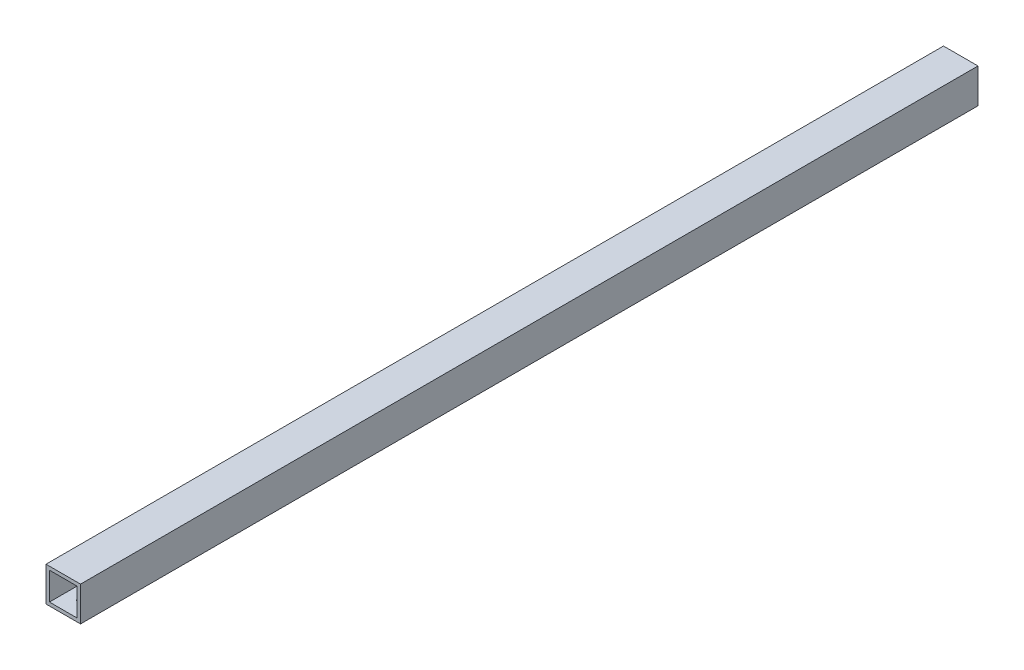
ISO-10303-21;
HEADER;
FILE_DESCRIPTION(('STEP AP214'),'2;1');
FILE_NAME('part.step','',(''),(''),'','','');
FILE_SCHEMA(('AUTOMOTIVE_DESIGN { 1 0 10303 214 1 1 1 1 }'));
ENDSEC;
DATA;
#1=APPLICATION_CONTEXT('core data for automotive mechanical design processes');
#2=APPLICATION_PROTOCOL_DEFINITION('international standard','automotive_design',2000,#1);
#3=PRODUCT_CONTEXT('',#1,'mechanical');
#4=PRODUCT('Part','Part','',(#3));
#5=PRODUCT_RELATED_PRODUCT_CATEGORY('part','',(#4));
#6=PRODUCT_DEFINITION_FORMATION('','',#4);
#7=PRODUCT_DEFINITION_CONTEXT('part definition',#1,'design');
#8=PRODUCT_DEFINITION('design','',#6,#7);
#9=PRODUCT_DEFINITION_SHAPE('','',#8);
#10=(LENGTH_UNIT() NAMED_UNIT(*) SI_UNIT(.MILLI.,.METRE.));
#11=(NAMED_UNIT(*) PLANE_ANGLE_UNIT() SI_UNIT($,.RADIAN.));
#12=(NAMED_UNIT(*) SI_UNIT($,.STERADIAN.) SOLID_ANGLE_UNIT());
#13=UNCERTAINTY_MEASURE_WITH_UNIT(LENGTH_MEASURE(1.E-05),#10,'distance_accuracy_value','');
#14=(GEOMETRIC_REPRESENTATION_CONTEXT(3) GLOBAL_UNCERTAINTY_ASSIGNED_CONTEXT((#13)) GLOBAL_UNIT_ASSIGNED_CONTEXT((#10,
#11,#12)) REPRESENTATION_CONTEXT('',''));
#15=CARTESIAN_POINT('',(0.,0.,0.));
#16=DIRECTION('',(0.,0.,1.));
#17=DIRECTION('',(1.,0.,0.));
#18=AXIS2_PLACEMENT_3D('',#15,#16,#17);
#19=CARTESIAN_POINT('',(10.,10.,560.));
#20=DIRECTION('',(-1.,0.,0.));
#21=DIRECTION('',(0.,0.,1.));
#22=AXIS2_PLACEMENT_3D('',#19,#20,#21);
#23=PLANE('',#22);
#24=DIRECTION('',(0.,1.,0.));
#25=VECTOR('',#24,1.);
#26=CARTESIAN_POINT('',(10.,10.,540.));
#27=LINE('',#26,#25);
#28=CARTESIAN_POINT('',(10.,-10.,540.));
#29=VERTEX_POINT('',#28);
#30=CARTESIAN_POINT('',(10.,10.,540.));
#31=VERTEX_POINT('',#30);
#32=EDGE_CURVE('E163',#29,#31,#27,.T.);
#33=ORIENTED_EDGE('',*,*,#32,.F.);
#34=DIRECTION('',(0.,0.,-1.));
#35=VECTOR('',#34,1.);
#36=CARTESIAN_POINT('',(10.,-10.,560.));
#37=LINE('',#36,#35);
#38=CARTESIAN_POINT('',(10.,-10.,20.));
#39=VERTEX_POINT('',#38);
#40=EDGE_CURVE('E135',#29,#39,#37,.T.);
#41=ORIENTED_EDGE('',*,*,#40,.T.);
#42=DIRECTION('',(0.,-1.,0.));
#43=VECTOR('',#42,1.);
#44=CARTESIAN_POINT('',(10.,10.,20.));
#45=LINE('',#44,#43);
#46=CARTESIAN_POINT('',(10.,10.,20.));
#47=VERTEX_POINT('',#46);
#48=EDGE_CURVE('E130',#47,#39,#45,.T.);
#49=ORIENTED_EDGE('',*,*,#48,.F.);
#50=DIRECTION('',(0.,0.,-1.));
#51=VECTOR('',#50,1.);
#52=CARTESIAN_POINT('',(10.,10.,560.));
#53=LINE('',#52,#51);
#54=EDGE_CURVE('E141',#31,#47,#53,.T.);
#55=ORIENTED_EDGE('',*,*,#54,.F.);
#56=EDGE_LOOP('',(#33,#41,#49,#55));
#57=FACE_BOUND('',#56,.T.);
#58=ADVANCED_FACE('F44',(#57),#23,.F.);
#59=CARTESIAN_POINT('',(-10.,10.,560.));
#60=DIRECTION('',(0.,-1.,0.));
#61=DIRECTION('',(1.,0.,0.));
#62=AXIS2_PLACEMENT_3D('',#59,#60,#61);
#63=PLANE('',#62);
#64=DIRECTION('',(-1.,0.,0.));
#65=VECTOR('',#64,1.);
#66=CARTESIAN_POINT('',(-10.,10.,540.));
#67=LINE('',#66,#65);
#68=CARTESIAN_POINT('',(-10.,10.,540.));
#69=VERTEX_POINT('',#68);
#70=EDGE_CURVE('E161',#31,#69,#67,.T.);
#71=ORIENTED_EDGE('',*,*,#70,.F.);
#72=ORIENTED_EDGE('',*,*,#54,.T.);
#73=DIRECTION('',(1.,0.,0.));
#74=VECTOR('',#73,1.);
#75=CARTESIAN_POINT('',(-10.,10.,20.));
#76=LINE('',#75,#74);
#77=CARTESIAN_POINT('',(-10.,10.,20.));
#78=VERTEX_POINT('',#77);
#79=EDGE_CURVE('E179',#78,#47,#76,.T.);
#80=ORIENTED_EDGE('',*,*,#79,.F.);
#81=DIRECTION('',(0.,0.,-1.));
#82=VECTOR('',#81,1.);
#83=CARTESIAN_POINT('',(-10.,10.,560.));
#84=LINE('',#83,#82);
#85=EDGE_CURVE('E139',#69,#78,#84,.T.);
#86=ORIENTED_EDGE('',*,*,#85,.F.);
#87=EDGE_LOOP('',(#71,#72,#80,#86));
#88=FACE_BOUND('',#87,.T.);
#89=ADVANCED_FACE('F199',(#88),#63,.F.);
#90=CARTESIAN_POINT('',(-10.,10.,560.));
#91=DIRECTION('',(1.,0.,0.));
#92=DIRECTION('',(0.,1.,0.));
#93=AXIS2_PLACEMENT_3D('',#90,#91,#92);
#94=PLANE('',#93);
#95=DIRECTION('',(0.,-1.,0.));
#96=VECTOR('',#95,1.);
#97=CARTESIAN_POINT('',(-10.,10.,540.));
#98=LINE('',#97,#96);
#99=CARTESIAN_POINT('',(-10.,-10.,540.));
#100=VERTEX_POINT('',#99);
#101=EDGE_CURVE('E60',#69,#100,#98,.T.);
#102=ORIENTED_EDGE('',*,*,#101,.F.);
#103=ORIENTED_EDGE('',*,*,#85,.T.);
#104=DIRECTION('',(0.,1.,0.));
#105=VECTOR('',#104,1.);
#106=CARTESIAN_POINT('',(-10.,10.,20.));
#107=LINE('',#106,#105);
#108=CARTESIAN_POINT('',(-10.,-10.,20.));
#109=VERTEX_POINT('',#108);
#110=EDGE_CURVE('E176',#109,#78,#107,.T.);
#111=ORIENTED_EDGE('',*,*,#110,.F.);
#112=DIRECTION('',(0.,0.,-1.));
#113=VECTOR('',#112,1.);
#114=CARTESIAN_POINT('',(-10.,-10.,560.));
#115=LINE('',#114,#113);
#116=EDGE_CURVE('E137',#100,#109,#115,.T.);
#117=ORIENTED_EDGE('',*,*,#116,.F.);
#118=EDGE_LOOP('',(#102,#103,#111,#117));
#119=FACE_BOUND('',#118,.T.);
#120=ADVANCED_FACE('F195',(#119),#94,.F.);
#121=CARTESIAN_POINT('',(-10.,-10.,560.));
#122=DIRECTION('',(0.,1.,0.));
#123=DIRECTION('',(0.,0.,1.));
#124=AXIS2_PLACEMENT_3D('',#121,#122,#123);
#125=PLANE('',#124);
#126=CARTESIAN_POINT('',(0.,-10.,30.));
#127=DIRECTION('',(0.,-1.,0.));
#128=DIRECTION('',(0.,0.,-1.));
#129=AXIS2_PLACEMENT_3D('',#126,#127,#128);
#130=CIRCLE('',#129,1.64999999999999);
#131=CARTESIAN_POINT('',(0.,-10.,28.35));
#132=VERTEX_POINT('',#131);
#133=EDGE_CURVE('E262',#132,#132,#130,.T.);
#134=ORIENTED_EDGE('',*,*,#133,.F.);
#135=EDGE_LOOP('',(#134));
#136=FACE_BOUND('',#135,.T.);
#137=CARTESIAN_POINT('',(0.,-10.,50.));
#138=DIRECTION('',(0.,-1.,0.));
#139=DIRECTION('',(0.,0.,-1.));
#140=AXIS2_PLACEMENT_3D('',#137,#138,#139);
#141=CIRCLE('',#140,1.64999999999999);
#142=CARTESIAN_POINT('',(0.,-10.,48.35));
#143=VERTEX_POINT('',#142);
#144=EDGE_CURVE('E256',#143,#143,#141,.T.);
#145=ORIENTED_EDGE('',*,*,#144,.F.);
#146=EDGE_LOOP('',(#145));
#147=FACE_BOUND('',#146,.T.);
#148=CARTESIAN_POINT('',(0.,-10.,510.));
#149=DIRECTION('',(0.,-1.,0.));
#150=DIRECTION('',(0.,0.,-1.));
#151=AXIS2_PLACEMENT_3D('',#148,#149,#150);
#152=CIRCLE('',#151,1.64999999999999);
#153=CARTESIAN_POINT('',(0.,-10.,508.35));
#154=VERTEX_POINT('',#153);
#155=EDGE_CURVE('E152',#154,#154,#152,.T.);
#156=ORIENTED_EDGE('',*,*,#155,.F.);
#157=EDGE_LOOP('',(#156));
#158=FACE_BOUND('',#157,.T.);
#159=CARTESIAN_POINT('',(0.,-10.,530.));
#160=DIRECTION('',(0.,-1.,0.));
#161=DIRECTION('',(0.,0.,-1.));
#162=AXIS2_PLACEMENT_3D('',#159,#160,#161);
#163=CIRCLE('',#162,1.64999999999999);
#164=CARTESIAN_POINT('',(0.,-10.,528.35));
#165=VERTEX_POINT('',#164);
#166=EDGE_CURVE('E144',#165,#165,#163,.T.);
#167=ORIENTED_EDGE('',*,*,#166,.F.);
#168=EDGE_LOOP('',(#167));
#169=FACE_BOUND('',#168,.T.);
#170=DIRECTION('',(1.,0.,0.));
#171=VECTOR('',#170,1.);
#172=CARTESIAN_POINT('',(-10.,-10.,540.));
#173=LINE('',#172,#171);
#174=EDGE_CURVE('E158',#100,#29,#173,.T.);
#175=ORIENTED_EDGE('',*,*,#174,.F.);
#176=ORIENTED_EDGE('',*,*,#116,.T.);
#177=DIRECTION('',(-1.,0.,0.));
#178=VECTOR('',#177,1.);
#179=CARTESIAN_POINT('',(-10.,-10.,20.));
#180=LINE('',#179,#178);
#181=EDGE_CURVE('E173',#39,#109,#180,.T.);
#182=ORIENTED_EDGE('',*,*,#181,.F.);
#183=ORIENTED_EDGE('',*,*,#40,.F.);
#184=EDGE_LOOP('',(#175,#176,#182,#183));
#185=FACE_BOUND('',#184,.T.);
#186=ADVANCED_FACE('F192',(#136,#147,#158,#169,#185),#125,.F.);
#187=CARTESIAN_POINT('',(8.,8.,560.));
#188=DIRECTION('',(-1.,0.,0.));
#189=DIRECTION('',(0.,0.,1.));
#190=AXIS2_PLACEMENT_3D('',#187,#188,#189);
#191=PLANE('',#190);
#192=DIRECTION('',(0.,0.,-1.));
#193=VECTOR('',#192,1.);
#194=CARTESIAN_POINT('',(8.,-8.,560.));
#195=LINE('',#194,#193);
#196=CARTESIAN_POINT('',(8.,-8.,540.));
#197=VERTEX_POINT('',#196);
#198=CARTESIAN_POINT('',(8.,-8.,20.));
#199=VERTEX_POINT('',#198);
#200=EDGE_CURVE('E126',#197,#199,#195,.T.);
#201=ORIENTED_EDGE('',*,*,#200,.F.);
#202=DIRECTION('',(0.,1.,0.));
#203=VECTOR('',#202,1.);
#204=CARTESIAN_POINT('',(8.,8.,540.));
#205=LINE('',#204,#203);
#206=CARTESIAN_POINT('',(8.,8.,540.));
#207=VERTEX_POINT('',#206);
#208=EDGE_CURVE('E68',#197,#207,#205,.T.);
#209=ORIENTED_EDGE('',*,*,#208,.T.);
#210=DIRECTION('',(0.,0.,-1.));
#211=VECTOR('',#210,1.);
#212=CARTESIAN_POINT('',(8.,8.,560.));
#213=LINE('',#212,#211);
#214=CARTESIAN_POINT('',(8.,8.,20.));
#215=VERTEX_POINT('',#214);
#216=EDGE_CURVE('E128',#207,#215,#213,.T.);
#217=ORIENTED_EDGE('',*,*,#216,.T.);
#218=DIRECTION('',(0.,-1.,0.));
#219=VECTOR('',#218,1.);
#220=CARTESIAN_POINT('',(8.,8.,20.));
#221=LINE('',#220,#219);
#222=EDGE_CURVE('E170',#215,#199,#221,.T.);
#223=ORIENTED_EDGE('',*,*,#222,.T.);
#224=EDGE_LOOP('',(#201,#209,#217,#223));
#225=FACE_BOUND('',#224,.T.);
#226=ADVANCED_FACE('F223',(#225),#191,.T.);
#227=CARTESIAN_POINT('',(-8.,8.,560.));
#228=DIRECTION('',(0.,-1.,0.));
#229=DIRECTION('',(0.,0.,-1.));
#230=AXIS2_PLACEMENT_3D('',#227,#228,#229);
#231=PLANE('',#230);
#232=ORIENTED_EDGE('',*,*,#216,.F.);
#233=DIRECTION('',(-1.,0.,0.));
#234=VECTOR('',#233,1.);
#235=CARTESIAN_POINT('',(-8.,8.,540.));
#236=LINE('',#235,#234);
#237=CARTESIAN_POINT('',(-8.,8.,540.));
#238=VERTEX_POINT('',#237);
#239=EDGE_CURVE('E120',#207,#238,#236,.T.);
#240=ORIENTED_EDGE('',*,*,#239,.T.);
#241=DIRECTION('',(0.,0.,-1.));
#242=VECTOR('',#241,1.);
#243=CARTESIAN_POINT('',(-8.,8.,560.));
#244=LINE('',#243,#242);
#245=CARTESIAN_POINT('',(-8.,8.,20.));
#246=VERTEX_POINT('',#245);
#247=EDGE_CURVE('E119',#238,#246,#244,.T.);
#248=ORIENTED_EDGE('',*,*,#247,.T.);
#249=DIRECTION('',(1.,0.,0.));
#250=VECTOR('',#249,1.);
#251=CARTESIAN_POINT('',(-8.,8.,20.));
#252=LINE('',#251,#250);
#253=EDGE_CURVE('E167',#246,#215,#252,.T.);
#254=ORIENTED_EDGE('',*,*,#253,.T.);
#255=EDGE_LOOP('',(#232,#240,#248,#254));
#256=FACE_BOUND('',#255,.T.);
#257=ADVANCED_FACE('F227',(#256),#231,.T.);
#258=CARTESIAN_POINT('',(-8.,8.,560.));
#259=DIRECTION('',(1.,0.,0.));
#260=DIRECTION('',(0.,0.,-1.));
#261=AXIS2_PLACEMENT_3D('',#258,#259,#260);
#262=PLANE('',#261);
#263=ORIENTED_EDGE('',*,*,#247,.F.);
#264=DIRECTION('',(0.,-1.,0.));
#265=VECTOR('',#264,1.);
#266=CARTESIAN_POINT('',(-8.,8.,540.));
#267=LINE('',#266,#265);
#268=CARTESIAN_POINT('',(-8.,-8.,540.));
#269=VERTEX_POINT('',#268);
#270=EDGE_CURVE('E108',#238,#269,#267,.T.);
#271=ORIENTED_EDGE('',*,*,#270,.T.);
#272=DIRECTION('',(0.,0.,-1.));
#273=VECTOR('',#272,1.);
#274=CARTESIAN_POINT('',(-8.,-8.,560.));
#275=LINE('',#274,#273);
#276=CARTESIAN_POINT('',(-8.,-8.,20.));
#277=VERTEX_POINT('',#276);
#278=EDGE_CURVE('E117',#269,#277,#275,.T.);
#279=ORIENTED_EDGE('',*,*,#278,.T.);
#280=DIRECTION('',(0.,1.,0.));
#281=VECTOR('',#280,1.);
#282=CARTESIAN_POINT('',(-8.,8.,20.));
#283=LINE('',#282,#281);
#284=EDGE_CURVE('E165',#277,#246,#283,.T.);
#285=ORIENTED_EDGE('',*,*,#284,.T.);
#286=EDGE_LOOP('',(#263,#271,#279,#285));
#287=FACE_BOUND('',#286,.T.);
#288=ADVANCED_FACE('F115',(#287),#262,.T.);
#289=CARTESIAN_POINT('',(-8.,-8.,560.));
#290=DIRECTION('',(0.,1.,0.));
#291=DIRECTION('',(0.,0.,1.));
#292=AXIS2_PLACEMENT_3D('',#289,#290,#291);
#293=PLANE('',#292);
#294=CARTESIAN_POINT('',(0.,-8.,30.));
#295=DIRECTION('',(0.,1.,0.));
#296=DIRECTION('',(0.,0.,1.));
#297=AXIS2_PLACEMENT_3D('',#294,#295,#296);
#298=CIRCLE('',#297,1.64999999999999);
#299=CARTESIAN_POINT('',(0.,-8.,31.65));
#300=VERTEX_POINT('',#299);
#301=EDGE_CURVE('E241',#300,#300,#298,.T.);
#302=ORIENTED_EDGE('',*,*,#301,.F.);
#303=EDGE_LOOP('',(#302));
#304=FACE_BOUND('',#303,.T.);
#305=CARTESIAN_POINT('',(0.,-8.,50.));
#306=DIRECTION('',(0.,1.,0.));
#307=DIRECTION('',(0.,0.,1.));
#308=AXIS2_PLACEMENT_3D('',#305,#306,#307);
#309=CIRCLE('',#308,1.64999999999999);
#310=CARTESIAN_POINT('',(0.,-8.,51.65));
#311=VERTEX_POINT('',#310);
#312=EDGE_CURVE('E245',#311,#311,#309,.T.);
#313=ORIENTED_EDGE('',*,*,#312,.F.);
#314=EDGE_LOOP('',(#313));
#315=FACE_BOUND('',#314,.T.);
#316=CARTESIAN_POINT('',(0.,-8.,510.));
#317=DIRECTION('',(0.,1.,0.));
#318=DIRECTION('',(0.,0.,1.));
#319=AXIS2_PLACEMENT_3D('',#316,#317,#318);
#320=CIRCLE('',#319,1.64999999999999);
#321=CARTESIAN_POINT('',(0.,-8.,511.65));
#322=VERTEX_POINT('',#321);
#323=EDGE_CURVE('E47',#322,#322,#320,.T.);
#324=ORIENTED_EDGE('',*,*,#323,.F.);
#325=EDGE_LOOP('',(#324));
#326=FACE_BOUND('',#325,.T.);
#327=CARTESIAN_POINT('',(0.,-8.,530.));
#328=DIRECTION('',(0.,1.,0.));
#329=DIRECTION('',(0.,0.,1.));
#330=AXIS2_PLACEMENT_3D('',#327,#328,#329);
#331=CIRCLE('',#330,1.64999999999999);
#332=CARTESIAN_POINT('',(0.,-8.,531.65));
#333=VERTEX_POINT('',#332);
#334=EDGE_CURVE('E121',#333,#333,#331,.T.);
#335=ORIENTED_EDGE('',*,*,#334,.F.);
#336=EDGE_LOOP('',(#335));
#337=FACE_BOUND('',#336,.T.);
#338=ORIENTED_EDGE('',*,*,#278,.F.);
#339=DIRECTION('',(1.,0.,0.));
#340=VECTOR('',#339,1.);
#341=CARTESIAN_POINT('',(-8.,-8.,540.));
#342=LINE('',#341,#340);
#343=EDGE_CURVE('E12',#269,#197,#342,.T.);
#344=ORIENTED_EDGE('',*,*,#343,.T.);
#345=ORIENTED_EDGE('',*,*,#200,.T.);
#346=DIRECTION('',(-1.,0.,0.));
#347=VECTOR('',#346,1.);
#348=CARTESIAN_POINT('',(-8.,-8.,20.));
#349=LINE('',#348,#347);
#350=EDGE_CURVE('E52',#199,#277,#349,.T.);
#351=ORIENTED_EDGE('',*,*,#350,.T.);
#352=EDGE_LOOP('',(#338,#344,#345,#351));
#353=FACE_BOUND('',#352,.T.);
#354=ADVANCED_FACE('F124',(#304,#315,#326,#337,#353),#293,.T.);
#355=CARTESIAN_POINT('',(0.,0.,20.));
#356=DIRECTION('',(0.,0.,-1.));
#357=DIRECTION('',(-1.,0.,0.));
#358=AXIS2_PLACEMENT_3D('',#355,#356,#357);
#359=PLANE('',#358);
#360=ORIENTED_EDGE('',*,*,#253,.F.);
#361=ORIENTED_EDGE('',*,*,#284,.F.);
#362=ORIENTED_EDGE('',*,*,#350,.F.);
#363=ORIENTED_EDGE('',*,*,#222,.F.);
#364=EDGE_LOOP('',(#360,#361,#362,#363));
#365=FACE_BOUND('',#364,.T.);
#366=ORIENTED_EDGE('',*,*,#48,.T.);
#367=ORIENTED_EDGE('',*,*,#181,.T.);
#368=ORIENTED_EDGE('',*,*,#110,.T.);
#369=ORIENTED_EDGE('',*,*,#79,.T.);
#370=EDGE_LOOP('',(#366,#367,#368,#369));
#371=FACE_BOUND('',#370,.T.);
#372=ADVANCED_FACE('F185',(#365,#371),#359,.T.);
#373=CARTESIAN_POINT('',(0.,0.,540.));
#374=DIRECTION('',(0.,0.,1.));
#375=DIRECTION('',(1.,0.,0.));
#376=AXIS2_PLACEMENT_3D('',#373,#374,#375);
#377=PLANE('',#376);
#378=ORIENTED_EDGE('',*,*,#343,.F.);
#379=ORIENTED_EDGE('',*,*,#270,.F.);
#380=ORIENTED_EDGE('',*,*,#239,.F.);
#381=ORIENTED_EDGE('',*,*,#208,.F.);
#382=EDGE_LOOP('',(#378,#379,#380,#381));
#383=FACE_BOUND('',#382,.T.);
#384=ORIENTED_EDGE('',*,*,#32,.T.);
#385=ORIENTED_EDGE('',*,*,#70,.T.);
#386=ORIENTED_EDGE('',*,*,#101,.T.);
#387=ORIENTED_EDGE('',*,*,#174,.T.);
#388=EDGE_LOOP('',(#384,#385,#386,#387));
#389=FACE_BOUND('',#388,.T.);
#390=ADVANCED_FACE('F107',(#383,#389),#377,.T.);
#391=CARTESIAN_POINT('',(0.,-10.,530.));
#392=DIRECTION('',(0.,-1.,0.));
#393=DIRECTION('',(0.,0.,-1.));
#394=AXIS2_PLACEMENT_3D('',#391,#392,#393);
#395=CYLINDRICAL_SURFACE('',#394,1.64999999999999);
#396=ORIENTED_EDGE('',*,*,#334,.T.);
#397=EDGE_LOOP('',(#396));
#398=FACE_BOUND('',#397,.T.);
#399=ORIENTED_EDGE('',*,*,#166,.T.);
#400=EDGE_LOOP('',(#399));
#401=FACE_BOUND('',#400,.T.);
#402=ADVANCED_FACE('F202',(#398,#401),#395,.F.);
#403=CARTESIAN_POINT('',(0.,-10.,510.));
#404=DIRECTION('',(0.,-1.,0.));
#405=DIRECTION('',(0.,0.,-1.));
#406=AXIS2_PLACEMENT_3D('',#403,#404,#405);
#407=CYLINDRICAL_SURFACE('',#406,1.64999999999999);
#408=ORIENTED_EDGE('',*,*,#323,.T.);
#409=EDGE_LOOP('',(#408));
#410=FACE_BOUND('',#409,.T.);
#411=ORIENTED_EDGE('',*,*,#155,.T.);
#412=EDGE_LOOP('',(#411));
#413=FACE_BOUND('',#412,.T.);
#414=ADVANCED_FACE('F208',(#410,#413),#407,.F.);
#415=CARTESIAN_POINT('',(0.,-10.,50.));
#416=DIRECTION('',(0.,-1.,0.));
#417=DIRECTION('',(0.,0.,-1.));
#418=AXIS2_PLACEMENT_3D('',#415,#416,#417);
#419=CYLINDRICAL_SURFACE('',#418,1.64999999999999);
#420=ORIENTED_EDGE('',*,*,#312,.T.);
#421=EDGE_LOOP('',(#420));
#422=FACE_BOUND('',#421,.T.);
#423=ORIENTED_EDGE('',*,*,#144,.T.);
#424=EDGE_LOOP('',(#423));
#425=FACE_BOUND('',#424,.T.);
#426=ADVANCED_FACE('F251',(#422,#425),#419,.F.);
#427=CARTESIAN_POINT('',(0.,-10.,30.));
#428=DIRECTION('',(0.,-1.,0.));
#429=DIRECTION('',(0.,0.,-1.));
#430=AXIS2_PLACEMENT_3D('',#427,#428,#429);
#431=CYLINDRICAL_SURFACE('',#430,1.64999999999999);
#432=ORIENTED_EDGE('',*,*,#301,.T.);
#433=EDGE_LOOP('',(#432));
#434=FACE_BOUND('',#433,.T.);
#435=ORIENTED_EDGE('',*,*,#133,.T.);
#436=EDGE_LOOP('',(#435));
#437=FACE_BOUND('',#436,.T.);
#438=ADVANCED_FACE('F266',(#434,#437),#431,.F.);
#439=CLOSED_SHELL('',(#58,#89,#120,#186,#226,#257,#288,#354,#372,#390,#402,#414,#426,#438));
#440=MANIFOLD_SOLID_BREP('B2',#439);
#441=ADVANCED_BREP_SHAPE_REPRESENTATION('',(#18,#440),#14);
#442=SHAPE_DEFINITION_REPRESENTATION(#9,#441);
ENDSEC;
END-ISO-10303-21;
